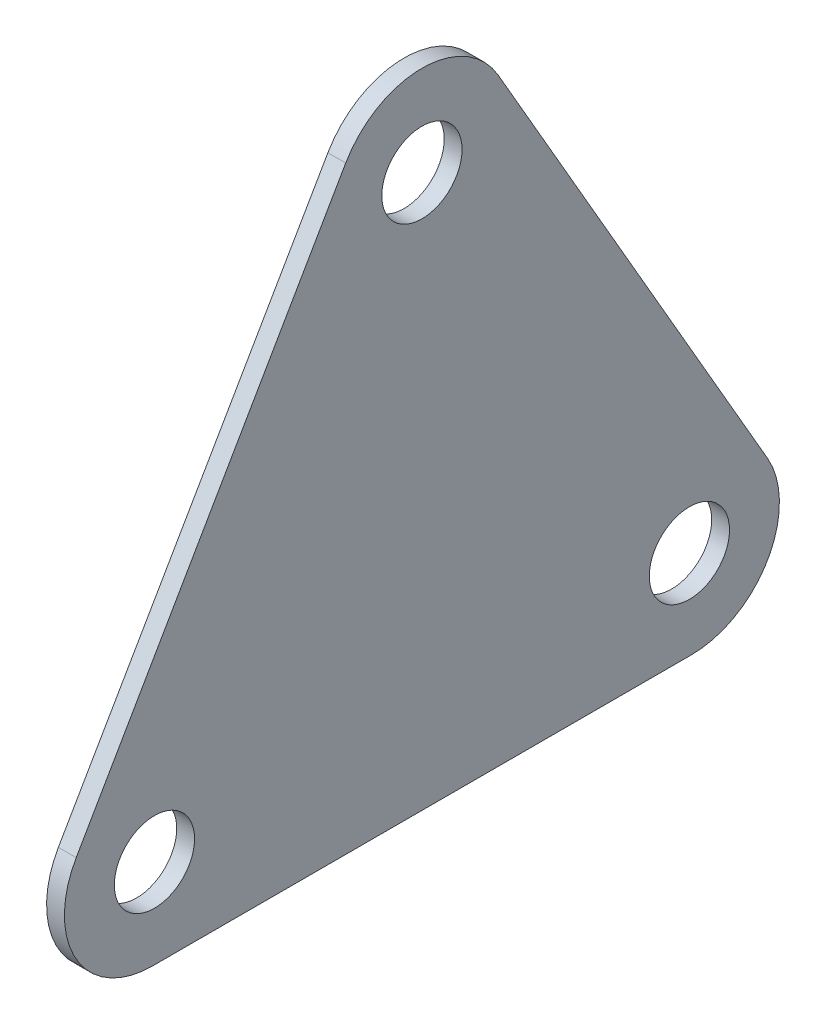
ISO-10303-21;
HEADER;
FILE_DESCRIPTION(('STEP AP214'),'2;1');
FILE_NAME('part.step','',(''),(''),'','','');
FILE_SCHEMA(('AUTOMOTIVE_DESIGN { 1 0 10303 214 1 1 1 1 }'));
ENDSEC;
DATA;
#1=APPLICATION_CONTEXT('core data for automotive mechanical design processes');
#2=APPLICATION_PROTOCOL_DEFINITION('international standard','automotive_design',2000,#1);
#3=PRODUCT_CONTEXT('',#1,'mechanical');
#4=PRODUCT('Part','Part','',(#3));
#5=PRODUCT_RELATED_PRODUCT_CATEGORY('part','',(#4));
#6=PRODUCT_DEFINITION_FORMATION('','',#4);
#7=PRODUCT_DEFINITION_CONTEXT('part definition',#1,'design');
#8=PRODUCT_DEFINITION('design','',#6,#7);
#9=PRODUCT_DEFINITION_SHAPE('','',#8);
#10=(LENGTH_UNIT() NAMED_UNIT(*) SI_UNIT(.MILLI.,.METRE.));
#11=(NAMED_UNIT(*) PLANE_ANGLE_UNIT() SI_UNIT($,.RADIAN.));
#12=(NAMED_UNIT(*) SI_UNIT($,.STERADIAN.) SOLID_ANGLE_UNIT());
#13=UNCERTAINTY_MEASURE_WITH_UNIT(LENGTH_MEASURE(1.E-05),#10,'distance_accuracy_value','');
#14=(GEOMETRIC_REPRESENTATION_CONTEXT(3) GLOBAL_UNCERTAINTY_ASSIGNED_CONTEXT((#13)) GLOBAL_UNIT_ASSIGNED_CONTEXT((#10,
#11,#12)) REPRESENTATION_CONTEXT('',''));
#15=CARTESIAN_POINT('',(0.,0.,0.));
#16=DIRECTION('',(0.,0.,1.));
#17=DIRECTION('',(1.,0.,0.));
#18=AXIS2_PLACEMENT_3D('',#15,#16,#17);
#19=CARTESIAN_POINT('',(1.,-0.0655887388312662,-16.4568866101497));
#20=DIRECTION('',(1.,0.,0.));
#21=DIRECTION('',(0.,0.,-1.));
#22=AXIS2_PLACEMENT_3D('',#19,#20,#21);
#23=PLANE('',#22);
#24=CARTESIAN_POINT('',(1.,0.,-16.3432835820896));
#25=DIRECTION('',(1.,0.,0.));
#26=DIRECTION('',(0.,0.,-1.));
#27=AXIS2_PLACEMENT_3D('',#24,#25,#26);
#28=CIRCLE('',#27,2.25);
#29=CARTESIAN_POINT('',(1.,0.,-18.5932835820896));
#30=VERTEX_POINT('',#29);
#31=EDGE_CURVE('E185',#30,#30,#28,.T.);
#32=ORIENTED_EDGE('',*,*,#31,.F.);
#33=EDGE_LOOP('',(#32));
#34=FACE_BOUND('',#33,.T.);
#35=CARTESIAN_POINT('',(1.,-0.0655887388312662,-16.4568866101497));
#36=DIRECTION('',(1.,0.,0.));
#37=DIRECTION('',(0.,0.,-1.));
#38=AXIS2_PLACEMENT_3D('',#35,#36,#37);
#39=CIRCLE('',#38,4.93441126116873);
#40=CARTESIAN_POINT('',(1.,-5.,-16.4568866101496));
#41=VERTEX_POINT('',#40);
#42=CARTESIAN_POINT('',(1.,2.40161689175316,-20.7302121150418));
#43=VERTEX_POINT('',#42);
#44=EDGE_CURVE('E130',#41,#43,#39,.T.);
#45=ORIENTED_EDGE('',*,*,#44,.T.);
#46=DIRECTION('',(0.,0.866025403784439,0.5));
#47=VECTOR('',#46,1.);
#48=CARTESIAN_POINT('',(1.,2.40161689175316,-20.7302121150418));
#49=LINE('',#48,#47);
#50=CARTESIAN_POINT('',(1.,28.57914522178,-5.61660908698172));
#51=VERTEX_POINT('',#50);
#52=EDGE_CURVE('E88',#43,#51,#49,.T.);
#53=ORIENTED_EDGE('',*,*,#52,.T.);
#54=CARTESIAN_POINT('',(1.,26.1119395911957,-1.34328358208955));
#55=DIRECTION('',(1.,0.,0.));
#56=DIRECTION('',(0.,0.,-1.));
#57=AXIS2_PLACEMENT_3D('',#54,#55,#56);
#58=CIRCLE('',#57,4.93441126116873);
#59=CARTESIAN_POINT('',(1.,28.57914522178,2.93004192280261));
#60=VERTEX_POINT('',#59);
#61=EDGE_CURVE('E101',#51,#60,#58,.T.);
#62=ORIENTED_EDGE('',*,*,#61,.T.);
#63=DIRECTION('',(0.,-0.866025403784439,0.5));
#64=VECTOR('',#63,1.);
#65=CARTESIAN_POINT('',(1.,28.57914522178,2.93004192280261));
#66=LINE('',#65,#64);
#67=CARTESIAN_POINT('',(1.,2.40161689175316,18.0436449508627));
#68=VERTEX_POINT('',#67);
#69=EDGE_CURVE('E95',#60,#68,#66,.T.);
#70=ORIENTED_EDGE('',*,*,#69,.T.);
#71=CARTESIAN_POINT('',(1.,-0.0655887388312654,13.7703194459706));
#72=DIRECTION('',(1.,0.,0.));
#73=DIRECTION('',(0.,0.,-1.));
#74=AXIS2_PLACEMENT_3D('',#71,#72,#73);
#75=CIRCLE('',#74,4.93441126116873);
#76=CARTESIAN_POINT('',(1.,-5.,13.7703194459705));
#77=VERTEX_POINT('',#76);
#78=EDGE_CURVE('E99',#68,#77,#75,.T.);
#79=ORIENTED_EDGE('',*,*,#78,.T.);
#80=DIRECTION('',(0.,0.,-1.));
#81=VECTOR('',#80,1.);
#82=CARTESIAN_POINT('',(1.,-5.,13.7703194459705));
#83=LINE('',#82,#81);
#84=EDGE_CURVE('E51',#77,#41,#83,.T.);
#85=ORIENTED_EDGE('',*,*,#84,.T.);
#86=EDGE_LOOP('',(#45,#53,#62,#70,#79,#85));
#87=FACE_BOUND('',#86,.T.);
#88=CARTESIAN_POINT('',(1.,0.,13.6567164179104));
#89=DIRECTION('',(1.,0.,0.));
#90=DIRECTION('',(0.,0.,-1.));
#91=AXIS2_PLACEMENT_3D('',#88,#89,#90);
#92=CIRCLE('',#91,2.25);
#93=CARTESIAN_POINT('',(1.,0.,11.4067164179104));
#94=VERTEX_POINT('',#93);
#95=EDGE_CURVE('E123',#94,#94,#92,.T.);
#96=ORIENTED_EDGE('',*,*,#95,.F.);
#97=EDGE_LOOP('',(#96));
#98=FACE_BOUND('',#97,.T.);
#99=CARTESIAN_POINT('',(1.,25.9807621135332,-1.34328358208956));
#100=DIRECTION('',(1.,0.,0.));
#101=DIRECTION('',(0.,0.,-1.));
#102=AXIS2_PLACEMENT_3D('',#99,#100,#101);
#103=CIRCLE('',#102,2.25);
#104=CARTESIAN_POINT('',(1.,25.9807621135332,-3.59328358208955));
#105=VERTEX_POINT('',#104);
#106=EDGE_CURVE('E176',#105,#105,#103,.T.);
#107=ORIENTED_EDGE('',*,*,#106,.F.);
#108=EDGE_LOOP('',(#107));
#109=FACE_BOUND('',#108,.T.);
#110=ADVANCED_FACE('F34',(#34,#87,#98,#109),#23,.T.);
#111=CARTESIAN_POINT('',(0.,-0.0655887388312662,-16.4568866101497));
#112=DIRECTION('',(1.,0.,0.));
#113=DIRECTION('',(0.,0.,-1.));
#114=AXIS2_PLACEMENT_3D('',#111,#112,#113);
#115=PLANE('',#114);
#116=CARTESIAN_POINT('',(0.,-0.0655887388312662,-16.4568866101497));
#117=DIRECTION('',(1.,0.,0.));
#118=DIRECTION('',(0.,0.,-1.));
#119=AXIS2_PLACEMENT_3D('',#116,#117,#118);
#120=CIRCLE('',#119,4.93441126116873);
#121=CARTESIAN_POINT('',(0.,-5.,-16.4568866101496));
#122=VERTEX_POINT('',#121);
#123=CARTESIAN_POINT('',(0.,2.40161689175316,-20.7302121150418));
#124=VERTEX_POINT('',#123);
#125=EDGE_CURVE('E119',#122,#124,#120,.T.);
#126=ORIENTED_EDGE('',*,*,#125,.F.);
#127=DIRECTION('',(0.,0.,-1.));
#128=VECTOR('',#127,1.);
#129=CARTESIAN_POINT('',(0.,-5.,13.7703194459705));
#130=LINE('',#129,#128);
#131=CARTESIAN_POINT('',(0.,-5.,13.7703194459705));
#132=VERTEX_POINT('',#131);
#133=EDGE_CURVE('E80',#132,#122,#130,.T.);
#134=ORIENTED_EDGE('',*,*,#133,.F.);
#135=CARTESIAN_POINT('',(0.,-0.0655887388312654,13.7703194459706));
#136=DIRECTION('',(1.,0.,0.));
#137=DIRECTION('',(0.,0.,-1.));
#138=AXIS2_PLACEMENT_3D('',#135,#136,#137);
#139=CIRCLE('',#138,4.93441126116873);
#140=CARTESIAN_POINT('',(0.,2.40161689175316,18.0436449508627));
#141=VERTEX_POINT('',#140);
#142=EDGE_CURVE('E74',#141,#132,#139,.T.);
#143=ORIENTED_EDGE('',*,*,#142,.F.);
#144=DIRECTION('',(0.,-0.866025403784439,0.5));
#145=VECTOR('',#144,1.);
#146=CARTESIAN_POINT('',(0.,28.57914522178,2.93004192280261));
#147=LINE('',#146,#145);
#148=CARTESIAN_POINT('',(0.,28.57914522178,2.93004192280261));
#149=VERTEX_POINT('',#148);
#150=EDGE_CURVE('E109',#149,#141,#147,.T.);
#151=ORIENTED_EDGE('',*,*,#150,.F.);
#152=CARTESIAN_POINT('',(0.,26.1119395911957,-1.34328358208955));
#153=DIRECTION('',(1.,0.,0.));
#154=DIRECTION('',(0.,0.,-1.));
#155=AXIS2_PLACEMENT_3D('',#152,#153,#154);
#156=CIRCLE('',#155,4.93441126116873);
#157=CARTESIAN_POINT('',(0.,28.57914522178,-5.61660908698172));
#158=VERTEX_POINT('',#157);
#159=EDGE_CURVE('E125',#158,#149,#156,.T.);
#160=ORIENTED_EDGE('',*,*,#159,.F.);
#161=DIRECTION('',(0.,0.866025403784439,0.5));
#162=VECTOR('',#161,1.);
#163=CARTESIAN_POINT('',(0.,2.40161689175316,-20.7302121150418));
#164=LINE('',#163,#162);
#165=EDGE_CURVE('E122',#124,#158,#164,.T.);
#166=ORIENTED_EDGE('',*,*,#165,.F.);
#167=EDGE_LOOP('',(#126,#134,#143,#151,#160,#166));
#168=FACE_BOUND('',#167,.T.);
#169=CARTESIAN_POINT('',(0.,0.,13.6567164179104));
#170=DIRECTION('',(1.,0.,0.));
#171=DIRECTION('',(0.,0.,-1.));
#172=AXIS2_PLACEMENT_3D('',#169,#170,#171);
#173=CIRCLE('',#172,2.25);
#174=CARTESIAN_POINT('',(0.,0.,11.4067164179104));
#175=VERTEX_POINT('',#174);
#176=EDGE_CURVE('E188',#175,#175,#173,.T.);
#177=ORIENTED_EDGE('',*,*,#176,.T.);
#178=EDGE_LOOP('',(#177));
#179=FACE_BOUND('',#178,.T.);
#180=CARTESIAN_POINT('',(0.,0.,-16.3432835820896));
#181=DIRECTION('',(1.,0.,0.));
#182=DIRECTION('',(0.,0.,-1.));
#183=AXIS2_PLACEMENT_3D('',#180,#181,#182);
#184=CIRCLE('',#183,2.25);
#185=CARTESIAN_POINT('',(0.,0.,-18.5932835820896));
#186=VERTEX_POINT('',#185);
#187=EDGE_CURVE('E182',#186,#186,#184,.T.);
#188=ORIENTED_EDGE('',*,*,#187,.T.);
#189=EDGE_LOOP('',(#188));
#190=FACE_BOUND('',#189,.T.);
#191=CARTESIAN_POINT('',(0.,25.9807621135332,-1.34328358208956));
#192=DIRECTION('',(1.,0.,0.));
#193=DIRECTION('',(0.,0.,-1.));
#194=AXIS2_PLACEMENT_3D('',#191,#192,#193);
#195=CIRCLE('',#194,2.25);
#196=CARTESIAN_POINT('',(0.,25.9807621135332,-3.59328358208955));
#197=VERTEX_POINT('',#196);
#198=EDGE_CURVE('E179',#197,#197,#195,.T.);
#199=ORIENTED_EDGE('',*,*,#198,.T.);
#200=EDGE_LOOP('',(#199));
#201=FACE_BOUND('',#200,.T.);
#202=ADVANCED_FACE('F139',(#168,#179,#190,#201),#115,.F.);
#203=CARTESIAN_POINT('',(1.,-0.0655887388312662,-16.4568866101497));
#204=DIRECTION('',(-1.,0.,0.));
#205=DIRECTION('',(0.,0.,1.));
#206=AXIS2_PLACEMENT_3D('',#203,#204,#205);
#207=CYLINDRICAL_SURFACE('',#206,4.93441126116873);
#208=ORIENTED_EDGE('',*,*,#125,.T.);
#209=DIRECTION('',(-1.,0.,0.));
#210=VECTOR('',#209,1.);
#211=CARTESIAN_POINT('',(1.,2.40161689175316,-20.7302121150418));
#212=LINE('',#211,#210);
#213=EDGE_CURVE('E11',#43,#124,#212,.T.);
#214=ORIENTED_EDGE('',*,*,#213,.F.);
#215=ORIENTED_EDGE('',*,*,#44,.F.);
#216=DIRECTION('',(-1.,0.,0.));
#217=VECTOR('',#216,1.);
#218=CARTESIAN_POINT('',(1.,-5.,-16.4568866101496));
#219=LINE('',#218,#217);
#220=EDGE_CURVE('E115',#41,#122,#219,.T.);
#221=ORIENTED_EDGE('',*,*,#220,.T.);
#222=EDGE_LOOP('',(#208,#214,#215,#221));
#223=FACE_BOUND('',#222,.T.);
#224=ADVANCED_FACE('F36',(#223),#207,.T.);
#225=CARTESIAN_POINT('',(1.,2.40161689175316,-20.7302121150418));
#226=DIRECTION('',(0.,-0.5,0.866025403784439));
#227=DIRECTION('',(0.,-0.866025403784439,-0.5));
#228=AXIS2_PLACEMENT_3D('',#225,#226,#227);
#229=PLANE('',#228);
#230=ORIENTED_EDGE('',*,*,#165,.T.);
#231=DIRECTION('',(-1.,0.,0.));
#232=VECTOR('',#231,1.);
#233=CARTESIAN_POINT('',(1.,28.57914522178,-5.61660908698172));
#234=LINE('',#233,#232);
#235=EDGE_CURVE('E43',#51,#158,#234,.T.);
#236=ORIENTED_EDGE('',*,*,#235,.F.);
#237=ORIENTED_EDGE('',*,*,#52,.F.);
#238=ORIENTED_EDGE('',*,*,#213,.T.);
#239=EDGE_LOOP('',(#230,#236,#237,#238));
#240=FACE_BOUND('',#239,.T.);
#241=ADVANCED_FACE('F238',(#240),#229,.F.);
#242=CARTESIAN_POINT('',(1.,26.1119395911957,-1.34328358208955));
#243=DIRECTION('',(-1.,0.,0.));
#244=DIRECTION('',(0.,0.,1.));
#245=AXIS2_PLACEMENT_3D('',#242,#243,#244);
#246=CYLINDRICAL_SURFACE('',#245,4.93441126116873);
#247=ORIENTED_EDGE('',*,*,#159,.T.);
#248=DIRECTION('',(-1.,0.,0.));
#249=VECTOR('',#248,1.);
#250=CARTESIAN_POINT('',(1.,28.57914522178,2.93004192280261));
#251=LINE('',#250,#249);
#252=EDGE_CURVE('E110',#60,#149,#251,.T.);
#253=ORIENTED_EDGE('',*,*,#252,.F.);
#254=ORIENTED_EDGE('',*,*,#61,.F.);
#255=ORIENTED_EDGE('',*,*,#235,.T.);
#256=EDGE_LOOP('',(#247,#253,#254,#255));
#257=FACE_BOUND('',#256,.T.);
#258=ADVANCED_FACE('F136',(#257),#246,.T.);
#259=CARTESIAN_POINT('',(1.,28.57914522178,2.93004192280261));
#260=DIRECTION('',(0.,-0.5,-0.866025403784439));
#261=DIRECTION('',(0.,0.866025403784439,-0.5));
#262=AXIS2_PLACEMENT_3D('',#259,#260,#261);
#263=PLANE('',#262);
#264=ORIENTED_EDGE('',*,*,#150,.T.);
#265=DIRECTION('',(-1.,0.,0.));
#266=VECTOR('',#265,1.);
#267=CARTESIAN_POINT('',(1.,2.40161689175316,18.0436449508627));
#268=LINE('',#267,#266);
#269=EDGE_CURVE('E106',#68,#141,#268,.T.);
#270=ORIENTED_EDGE('',*,*,#269,.F.);
#271=ORIENTED_EDGE('',*,*,#69,.F.);
#272=ORIENTED_EDGE('',*,*,#252,.T.);
#273=EDGE_LOOP('',(#264,#270,#271,#272));
#274=FACE_BOUND('',#273,.T.);
#275=ADVANCED_FACE('F107',(#274),#263,.F.);
#276=CARTESIAN_POINT('',(1.,-0.0655887388312654,13.7703194459706));
#277=DIRECTION('',(-1.,0.,0.));
#278=DIRECTION('',(0.,0.,1.));
#279=AXIS2_PLACEMENT_3D('',#276,#277,#278);
#280=CYLINDRICAL_SURFACE('',#279,4.93441126116873);
#281=ORIENTED_EDGE('',*,*,#142,.T.);
#282=DIRECTION('',(-1.,0.,0.));
#283=VECTOR('',#282,1.);
#284=CARTESIAN_POINT('',(1.,-5.,13.7703194459705));
#285=LINE('',#284,#283);
#286=EDGE_CURVE('E111',#77,#132,#285,.T.);
#287=ORIENTED_EDGE('',*,*,#286,.F.);
#288=ORIENTED_EDGE('',*,*,#78,.F.);
#289=ORIENTED_EDGE('',*,*,#269,.T.);
#290=EDGE_LOOP('',(#281,#287,#288,#289));
#291=FACE_BOUND('',#290,.T.);
#292=ADVANCED_FACE('F113',(#291),#280,.T.);
#293=CARTESIAN_POINT('',(1.,-5.,13.7703194459705));
#294=DIRECTION('',(0.,1.,0.));
#295=DIRECTION('',(0.,0.,1.));
#296=AXIS2_PLACEMENT_3D('',#293,#294,#295);
#297=PLANE('',#296);
#298=ORIENTED_EDGE('',*,*,#133,.T.);
#299=ORIENTED_EDGE('',*,*,#220,.F.);
#300=ORIENTED_EDGE('',*,*,#84,.F.);
#301=ORIENTED_EDGE('',*,*,#286,.T.);
#302=EDGE_LOOP('',(#298,#299,#300,#301));
#303=FACE_BOUND('',#302,.T.);
#304=ADVANCED_FACE('F144',(#303),#297,.F.);
#305=CARTESIAN_POINT('',(1.,0.,13.6567164179104));
#306=DIRECTION('',(-1.,0.,0.));
#307=DIRECTION('',(0.,0.,1.));
#308=AXIS2_PLACEMENT_3D('',#305,#306,#307);
#309=CYLINDRICAL_SURFACE('',#308,2.25);
#310=ORIENTED_EDGE('',*,*,#95,.T.);
#311=EDGE_LOOP('',(#310));
#312=FACE_BOUND('',#311,.T.);
#313=ORIENTED_EDGE('',*,*,#176,.F.);
#314=EDGE_LOOP('',(#313));
#315=FACE_BOUND('',#314,.T.);
#316=ADVANCED_FACE('F146',(#312,#315),#309,.F.);
#317=CARTESIAN_POINT('',(1.,0.,-16.3432835820896));
#318=DIRECTION('',(-1.,0.,0.));
#319=DIRECTION('',(0.,0.,1.));
#320=AXIS2_PLACEMENT_3D('',#317,#318,#319);
#321=CYLINDRICAL_SURFACE('',#320,2.25);
#322=ORIENTED_EDGE('',*,*,#31,.T.);
#323=EDGE_LOOP('',(#322));
#324=FACE_BOUND('',#323,.T.);
#325=ORIENTED_EDGE('',*,*,#187,.F.);
#326=EDGE_LOOP('',(#325));
#327=FACE_BOUND('',#326,.T.);
#328=ADVANCED_FACE('F152',(#324,#327),#321,.F.);
#329=CARTESIAN_POINT('',(1.,25.9807621135332,-1.34328358208956));
#330=DIRECTION('',(-1.,0.,0.));
#331=DIRECTION('',(0.,0.,1.));
#332=AXIS2_PLACEMENT_3D('',#329,#330,#331);
#333=CYLINDRICAL_SURFACE('',#332,2.25);
#334=ORIENTED_EDGE('',*,*,#106,.T.);
#335=EDGE_LOOP('',(#334));
#336=FACE_BOUND('',#335,.T.);
#337=ORIENTED_EDGE('',*,*,#198,.F.);
#338=EDGE_LOOP('',(#337));
#339=FACE_BOUND('',#338,.T.);
#340=ADVANCED_FACE('F167',(#336,#339),#333,.F.);
#341=CLOSED_SHELL('',(#110,#202,#224,#241,#258,#275,#292,#304,#316,#328,#340));
#342=MANIFOLD_SOLID_BREP('B2',#341);
#343=ADVANCED_BREP_SHAPE_REPRESENTATION('',(#18,#342),#14);
#344=SHAPE_DEFINITION_REPRESENTATION(#9,#343);
ENDSEC;
END-ISO-10303-21;
